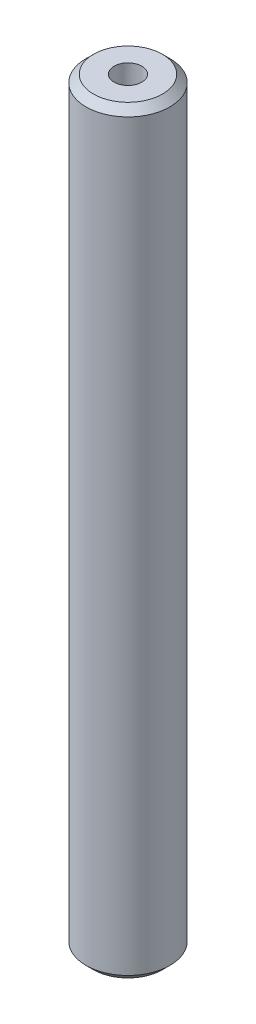
ISO-10303-21;
HEADER;
FILE_DESCRIPTION(('STEP AP214'),'2;1');
FILE_NAME('part.step','',(''),(''),'','','');
FILE_SCHEMA(('AUTOMOTIVE_DESIGN { 1 0 10303 214 1 1 1 1 }'));
ENDSEC;
DATA;
#1=APPLICATION_CONTEXT('core data for automotive mechanical design processes');
#2=APPLICATION_PROTOCOL_DEFINITION('international standard','automotive_design',2000,#1);
#3=PRODUCT_CONTEXT('',#1,'mechanical');
#4=PRODUCT('Part','Part','',(#3));
#5=PRODUCT_RELATED_PRODUCT_CATEGORY('part','',(#4));
#6=PRODUCT_DEFINITION_FORMATION('','',#4);
#7=PRODUCT_DEFINITION_CONTEXT('part definition',#1,'design');
#8=PRODUCT_DEFINITION('design','',#6,#7);
#9=PRODUCT_DEFINITION_SHAPE('','',#8);
#10=(LENGTH_UNIT() NAMED_UNIT(*) SI_UNIT(.MILLI.,.METRE.));
#11=(NAMED_UNIT(*) PLANE_ANGLE_UNIT() SI_UNIT($,.RADIAN.));
#12=(NAMED_UNIT(*) SI_UNIT($,.STERADIAN.) SOLID_ANGLE_UNIT());
#13=UNCERTAINTY_MEASURE_WITH_UNIT(LENGTH_MEASURE(1.E-05),#10,'distance_accuracy_value','');
#14=(GEOMETRIC_REPRESENTATION_CONTEXT(3) GLOBAL_UNCERTAINTY_ASSIGNED_CONTEXT((#13)) GLOBAL_UNIT_ASSIGNED_CONTEXT((#10,
#11,#12)) REPRESENTATION_CONTEXT('',''));
#15=CARTESIAN_POINT('',(0.,0.,0.));
#16=DIRECTION('',(0.,0.,1.));
#17=DIRECTION('',(1.,0.,0.));
#18=AXIS2_PLACEMENT_3D('',#15,#16,#17);
#19=CARTESIAN_POINT('',(0.,407.071947922105,0.));
#20=DIRECTION('',(0.,-1.,0.));
#21=DIRECTION('',(0.,0.,-1.));
#22=AXIS2_PLACEMENT_3D('',#19,#20,#21);
#23=CYLINDRICAL_SURFACE('',#22,22.5);
#24=CARTESIAN_POINT('',(0.,403.085499492276,0.));
#25=DIRECTION('',(0.,1.,0.));
#26=DIRECTION('',(0.,0.,1.));
#27=AXIS2_PLACEMENT_3D('',#24,#25,#26);
#28=CIRCLE('',#27,22.5);
#29=CARTESIAN_POINT('',(0.,403.085499492276,22.5));
#30=VERTEX_POINT('',#29);
#31=EDGE_CURVE('E50',#30,#30,#28,.F.);
#32=ORIENTED_EDGE('',*,*,#31,.T.);
#33=EDGE_LOOP('',(#32));
#34=FACE_BOUND('',#33,.T.);
#35=CARTESIAN_POINT('',(0.,3.9864484298292,0.));
#36=DIRECTION('',(0.,1.,0.));
#37=DIRECTION('',(0.,0.,1.));
#38=AXIS2_PLACEMENT_3D('',#35,#36,#37);
#39=CIRCLE('',#38,22.5);
#40=CARTESIAN_POINT('',(0.,3.9864484298292,22.5));
#41=VERTEX_POINT('',#40);
#42=EDGE_CURVE('E51',#41,#41,#39,.T.);
#43=ORIENTED_EDGE('',*,*,#42,.T.);
#44=EDGE_LOOP('',(#43));
#45=FACE_BOUND('',#44,.T.);
#46=ADVANCED_FACE('F39',(#34,#45),#23,.T.);
#47=CARTESIAN_POINT('',(0.,407.071947922105,0.));
#48=DIRECTION('',(0.,1.,0.));
#49=DIRECTION('',(0.,0.,1.));
#50=AXIS2_PLACEMENT_3D('',#47,#48,#49);
#51=PLANE('',#50);
#52=CARTESIAN_POINT('',(0.,407.071947922105,0.));
#53=DIRECTION('',(0.,1.,0.));
#54=DIRECTION('',(0.,0.,1.));
#55=AXIS2_PLACEMENT_3D('',#52,#53,#54);
#56=CIRCLE('',#55,18.5135515701708);
#57=CARTESIAN_POINT('',(0.,407.071947922105,18.5135515701708));
#58=VERTEX_POINT('',#57);
#59=EDGE_CURVE('E54',#58,#58,#56,.T.);
#60=ORIENTED_EDGE('',*,*,#59,.T.);
#61=EDGE_LOOP('',(#60));
#62=FACE_BOUND('',#61,.T.);
#63=CARTESIAN_POINT('',(0.,407.071947922105,0.));
#64=DIRECTION('',(0.,1.,0.));
#65=DIRECTION('',(0.,0.,1.));
#66=AXIS2_PLACEMENT_3D('',#63,#64,#65);
#67=CIRCLE('',#66,7.44681125408016);
#68=CARTESIAN_POINT('',(0.,407.071947922105,7.44681125408016));
#69=VERTEX_POINT('',#68);
#70=EDGE_CURVE('E58',#69,#69,#67,.T.);
#71=ORIENTED_EDGE('',*,*,#70,.F.);
#72=EDGE_LOOP('',(#71));
#73=FACE_BOUND('',#72,.T.);
#74=ADVANCED_FACE('F69',(#62,#73),#51,.T.);
#75=CARTESIAN_POINT('',(0.,0.,0.));
#76=DIRECTION('',(0.,1.,0.));
#77=DIRECTION('',(0.,0.,1.));
#78=AXIS2_PLACEMENT_3D('',#75,#76,#77);
#79=PLANE('',#78);
#80=CARTESIAN_POINT('',(0.,0.,0.));
#81=DIRECTION('',(0.,1.,0.));
#82=DIRECTION('',(0.,0.,1.));
#83=AXIS2_PLACEMENT_3D('',#80,#81,#82);
#84=CIRCLE('',#83,18.5135515701708);
#85=CARTESIAN_POINT('',(0.,0.,18.5135515701708));
#86=VERTEX_POINT('',#85);
#87=EDGE_CURVE('E10',#86,#86,#84,.F.);
#88=ORIENTED_EDGE('',*,*,#87,.T.);
#89=EDGE_LOOP('',(#88));
#90=FACE_BOUND('',#89,.T.);
#91=CARTESIAN_POINT('',(0.,0.,0.));
#92=DIRECTION('',(0.,1.,0.));
#93=DIRECTION('',(0.,0.,1.));
#94=AXIS2_PLACEMENT_3D('',#91,#92,#93);
#95=CIRCLE('',#94,7.44681125408016);
#96=CARTESIAN_POINT('',(0.,0.,7.44681125408016));
#97=VERTEX_POINT('',#96);
#98=EDGE_CURVE('E63',#97,#97,#95,.T.);
#99=ORIENTED_EDGE('',*,*,#98,.T.);
#100=EDGE_LOOP('',(#99));
#101=FACE_BOUND('',#100,.T.);
#102=ADVANCED_FACE('F75',(#90,#101),#79,.F.);
#103=CARTESIAN_POINT('',(0.,407.071947922105,0.));
#104=DIRECTION('',(0.,-1.,0.));
#105=DIRECTION('',(0.,0.,-1.));
#106=AXIS2_PLACEMENT_3D('',#103,#104,#105);
#107=CYLINDRICAL_SURFACE('',#106,7.44681125408016);
#108=ORIENTED_EDGE('',*,*,#70,.T.);
#109=EDGE_LOOP('',(#108));
#110=FACE_BOUND('',#109,.T.);
#111=ORIENTED_EDGE('',*,*,#98,.F.);
#112=EDGE_LOOP('',(#111));
#113=FACE_BOUND('',#112,.T.);
#114=ADVANCED_FACE('F70',(#110,#113),#107,.F.);
#115=CARTESIAN_POINT('',(0.,407.071947922105,0.));
#116=DIRECTION('',(0.,-1.,0.));
#117=DIRECTION('',(0.,0.,-1.));
#118=AXIS2_PLACEMENT_3D('',#115,#116,#117);
#119=CONICAL_SURFACE('',#118,18.5135515701708,0.785398163397439);
#120=ORIENTED_EDGE('',*,*,#31,.F.);
#121=EDGE_LOOP('',(#120));
#122=FACE_BOUND('',#121,.T.);
#123=ORIENTED_EDGE('',*,*,#59,.F.);
#124=EDGE_LOOP('',(#123));
#125=FACE_BOUND('',#124,.T.);
#126=ADVANCED_FACE('F81',(#122,#125),#119,.T.);
#127=CARTESIAN_POINT('',(0.,3.9864484298292,0.));
#128=DIRECTION('',(0.,1.,0.));
#129=DIRECTION('',(0.,0.,1.));
#130=AXIS2_PLACEMENT_3D('',#127,#128,#129);
#131=CONICAL_SURFACE('',#130,22.5,0.785398163397454);
#132=ORIENTED_EDGE('',*,*,#87,.F.);
#133=EDGE_LOOP('',(#132));
#134=FACE_BOUND('',#133,.T.);
#135=ORIENTED_EDGE('',*,*,#42,.F.);
#136=EDGE_LOOP('',(#135));
#137=FACE_BOUND('',#136,.T.);
#138=ADVANCED_FACE('F45',(#134,#137),#131,.T.);
#139=CLOSED_SHELL('',(#46,#74,#102,#114,#126,#138));
#140=MANIFOLD_SOLID_BREP('B2',#139);
#141=ADVANCED_BREP_SHAPE_REPRESENTATION('',(#18,#140),#14);
#142=SHAPE_DEFINITION_REPRESENTATION(#9,#141);
ENDSEC;
END-ISO-10303-21;
